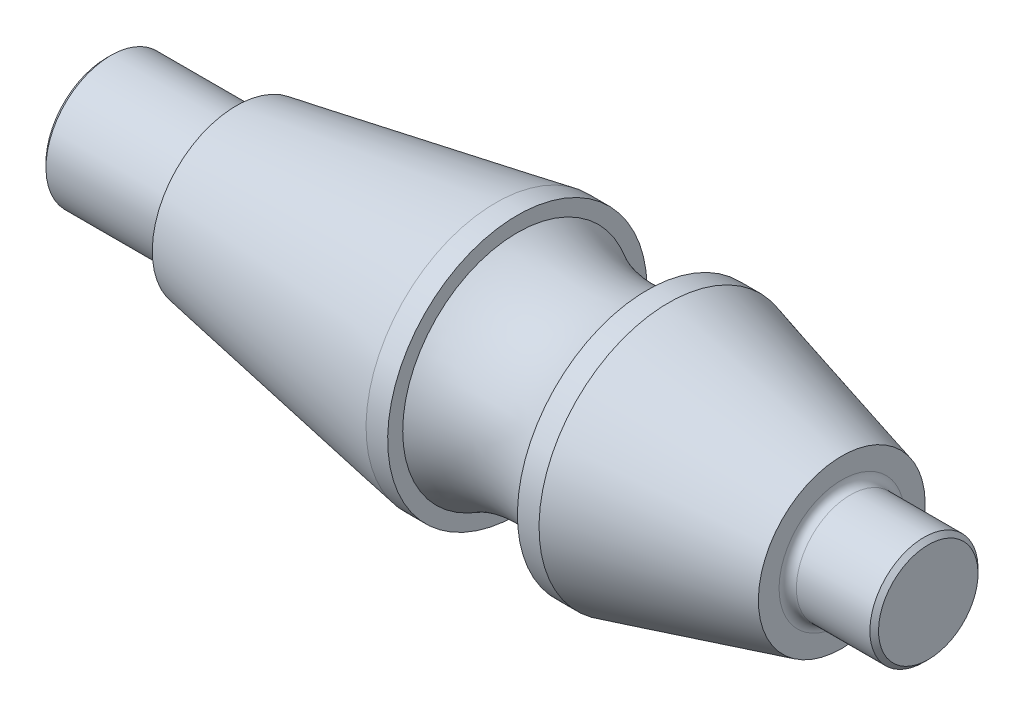
ISO-10303-21;
HEADER;
FILE_DESCRIPTION(('STEP AP214'),'2;1');
FILE_NAME('part.step','',(''),(''),'','','');
FILE_SCHEMA(('AUTOMOTIVE_DESIGN { 1 0 10303 214 1 1 1 1 }'));
ENDSEC;
DATA;
#1=APPLICATION_CONTEXT('core data for automotive mechanical design processes');
#2=APPLICATION_PROTOCOL_DEFINITION('international standard','automotive_design',2000,#1);
#3=PRODUCT_CONTEXT('',#1,'mechanical');
#4=PRODUCT('Part','Part','',(#3));
#5=PRODUCT_RELATED_PRODUCT_CATEGORY('part','',(#4));
#6=PRODUCT_DEFINITION_FORMATION('','',#4);
#7=PRODUCT_DEFINITION_CONTEXT('part definition',#1,'design');
#8=PRODUCT_DEFINITION('design','',#6,#7);
#9=PRODUCT_DEFINITION_SHAPE('','',#8);
#10=(LENGTH_UNIT() NAMED_UNIT(*) SI_UNIT(.MILLI.,.METRE.));
#11=(NAMED_UNIT(*) PLANE_ANGLE_UNIT() SI_UNIT($,.RADIAN.));
#12=(NAMED_UNIT(*) SI_UNIT($,.STERADIAN.) SOLID_ANGLE_UNIT());
#13=UNCERTAINTY_MEASURE_WITH_UNIT(LENGTH_MEASURE(1.E-05),#10,'distance_accuracy_value','');
#14=(GEOMETRIC_REPRESENTATION_CONTEXT(3) GLOBAL_UNCERTAINTY_ASSIGNED_CONTEXT((#13)) GLOBAL_UNIT_ASSIGNED_CONTEXT((#10,
#11,#12)) REPRESENTATION_CONTEXT('',''));
#15=CARTESIAN_POINT('',(0.,0.,0.));
#16=DIRECTION('',(0.,0.,1.));
#17=DIRECTION('',(1.,0.,0.));
#18=AXIS2_PLACEMENT_3D('',#15,#16,#17);
#19=CARTESIAN_POINT('',(95.,12.5,0.));
#20=DIRECTION('',(-1.,0.,0.));
#21=DIRECTION('',(0.,-1.,0.));
#22=AXIS2_PLACEMENT_3D('',#19,#20,#21);
#23=PLANE('',#22);
#24=CARTESIAN_POINT('',(95.,0.,0.));
#25=DIRECTION('',(-1.,0.,0.));
#26=DIRECTION('',(0.,-1.,0.));
#27=AXIS2_PLACEMENT_3D('',#24,#25,#26);
#28=CIRCLE('',#27,11.5);
#29=CARTESIAN_POINT('',(95.,-11.4999999999999,0.));
#30=VERTEX_POINT('',#29);
#31=EDGE_CURVE('E124',#30,#30,#28,.F.);
#32=ORIENTED_EDGE('',*,*,#31,.T.);
#33=EDGE_LOOP('',(#32));
#34=FACE_BOUND('',#33,.T.);
#35=ADVANCED_FACE('F51',(#34),#23,.F.);
#36=CARTESIAN_POINT('',(-95.,0.,0.));
#37=DIRECTION('',(-1.,0.,0.));
#38=DIRECTION('',(0.,-1.,0.));
#39=AXIS2_PLACEMENT_3D('',#36,#37,#38);
#40=CYLINDRICAL_SURFACE('',#39,12.5);
#41=CARTESIAN_POINT('',(77.,0.,0.));
#42=DIRECTION('',(-1.,0.,0.));
#43=DIRECTION('',(0.,-1.,0.));
#44=AXIS2_PLACEMENT_3D('',#41,#42,#43);
#45=CIRCLE('',#44,12.5);
#46=CARTESIAN_POINT('',(77.,-12.4999999999999,0.));
#47=VERTEX_POINT('',#46);
#48=EDGE_CURVE('E132',#47,#47,#45,.F.);
#49=ORIENTED_EDGE('',*,*,#48,.T.);
#50=EDGE_LOOP('',(#49));
#51=FACE_BOUND('',#50,.T.);
#52=CARTESIAN_POINT('',(94.,0.,0.));
#53=DIRECTION('',(-1.,0.,0.));
#54=DIRECTION('',(0.,-1.,0.));
#55=AXIS2_PLACEMENT_3D('',#52,#53,#54);
#56=CIRCLE('',#55,12.5);
#57=CARTESIAN_POINT('',(94.,-12.4999999999999,0.));
#58=VERTEX_POINT('',#57);
#59=EDGE_CURVE('E120',#58,#58,#56,.T.);
#60=ORIENTED_EDGE('',*,*,#59,.T.);
#61=EDGE_LOOP('',(#60));
#62=FACE_BOUND('',#61,.T.);
#63=ADVANCED_FACE('F153',(#51,#62),#40,.T.);
#64=CARTESIAN_POINT('',(75.,19.2820323027551,0.));
#65=DIRECTION('',(-1.,0.,0.));
#66=DIRECTION('',(0.,-1.,0.));
#67=AXIS2_PLACEMENT_3D('',#64,#65,#66);
#68=PLANE('',#67);
#69=CARTESIAN_POINT('',(75.,0.,0.));
#70=DIRECTION('',(-1.,0.,0.));
#71=DIRECTION('',(0.,-1.,0.));
#72=AXIS2_PLACEMENT_3D('',#69,#70,#71);
#73=CIRCLE('',#72,14.5);
#74=CARTESIAN_POINT('',(75.,-14.4999999999999,0.));
#75=VERTEX_POINT('',#74);
#76=EDGE_CURVE('E128',#75,#75,#73,.T.);
#77=ORIENTED_EDGE('',*,*,#76,.T.);
#78=EDGE_LOOP('',(#77));
#79=FACE_BOUND('',#78,.T.);
#80=CARTESIAN_POINT('',(75.,0.,0.));
#81=DIRECTION('',(-1.,0.,0.));
#82=DIRECTION('',(0.,-1.,0.));
#83=AXIS2_PLACEMENT_3D('',#80,#81,#82);
#84=CIRCLE('',#83,19.282032302755);
#85=CARTESIAN_POINT('',(75.,-19.282032302755,0.));
#86=VERTEX_POINT('',#85);
#87=EDGE_CURVE('E108',#86,#86,#84,.T.);
#88=ORIENTED_EDGE('',*,*,#87,.F.);
#89=EDGE_LOOP('',(#88));
#90=FACE_BOUND('',#89,.T.);
#91=ADVANCED_FACE('F161',(#79,#90),#68,.F.);
#92=CARTESIAN_POINT('',(75.,0.,0.));
#93=DIRECTION('',(-1.,0.,0.));
#94=DIRECTION('',(0.,-1.,0.));
#95=AXIS2_PLACEMENT_3D('',#92,#93,#94);
#96=CONICAL_SURFACE('',#95,19.282032302755,0.26179938779915);
#97=CARTESIAN_POINT('',(35.,0.,0.));
#98=DIRECTION('',(-1.,0.,0.));
#99=DIRECTION('',(0.,-1.,0.));
#100=AXIS2_PLACEMENT_3D('',#97,#98,#99);
#101=CIRCLE('',#100,30.);
#102=CARTESIAN_POINT('',(35.,-30.,0.));
#103=VERTEX_POINT('',#102);
#104=EDGE_CURVE('E104',#103,#103,#101,.T.);
#105=ORIENTED_EDGE('',*,*,#104,.F.);
#106=EDGE_LOOP('',(#105));
#107=FACE_BOUND('',#106,.T.);
#108=ORIENTED_EDGE('',*,*,#87,.T.);
#109=EDGE_LOOP('',(#108));
#110=FACE_BOUND('',#109,.T.);
#111=ADVANCED_FACE('F199',(#107,#110),#96,.T.);
#112=CARTESIAN_POINT('',(-95.,0.,0.));
#113=DIRECTION('',(-1.,0.,0.));
#114=DIRECTION('',(0.,-1.,0.));
#115=AXIS2_PLACEMENT_3D('',#112,#113,#114);
#116=CYLINDRICAL_SURFACE('',#115,30.);
#117=CARTESIAN_POINT('',(30.,0.,0.));
#118=DIRECTION('',(-1.,0.,0.));
#119=DIRECTION('',(0.,-1.,0.));
#120=AXIS2_PLACEMENT_3D('',#117,#118,#119);
#121=CIRCLE('',#120,30.);
#122=CARTESIAN_POINT('',(30.,-30.,0.));
#123=VERTEX_POINT('',#122);
#124=EDGE_CURVE('E100',#123,#123,#121,.T.);
#125=ORIENTED_EDGE('',*,*,#124,.F.);
#126=EDGE_LOOP('',(#125));
#127=FACE_BOUND('',#126,.T.);
#128=ORIENTED_EDGE('',*,*,#104,.T.);
#129=EDGE_LOOP('',(#128));
#130=FACE_BOUND('',#129,.T.);
#131=ADVANCED_FACE('F319',(#127,#130),#116,.T.);
#132=CARTESIAN_POINT('',(30.,30.,0.));
#133=DIRECTION('',(1.,0.,0.));
#134=DIRECTION('',(0.,1.,0.));
#135=AXIS2_PLACEMENT_3D('',#132,#133,#134);
#136=PLANE('',#135);
#137=CARTESIAN_POINT('',(30.,0.,0.));
#138=DIRECTION('',(-1.,0.,0.));
#139=DIRECTION('',(0.,-1.,0.));
#140=AXIS2_PLACEMENT_3D('',#137,#138,#139);
#141=CIRCLE('',#140,26.5192378864668);
#142=CARTESIAN_POINT('',(30.,-26.5192378864668,0.));
#143=VERTEX_POINT('',#142);
#144=EDGE_CURVE('E96',#143,#143,#141,.T.);
#145=ORIENTED_EDGE('',*,*,#144,.F.);
#146=EDGE_LOOP('',(#145));
#147=FACE_BOUND('',#146,.T.);
#148=ORIENTED_EDGE('',*,*,#124,.T.);
#149=EDGE_LOOP('',(#148));
#150=FACE_BOUND('',#149,.T.);
#151=ADVANCED_FACE('F310',(#147,#150),#136,.F.);
#152=CARTESIAN_POINT('',(15.,0.,0.));
#153=DIRECTION('',(-1.,0.,0.));
#154=DIRECTION('',(0.,-1.,0.));
#155=AXIS2_PLACEMENT_3D('',#152,#153,#154);
#156=TOROIDAL_SURFACE('',#155,52.5,30.);
#157=CARTESIAN_POINT('',(0.,0.,0.));
#158=DIRECTION('',(-1.,0.,0.));
#159=DIRECTION('',(0.,-1.,0.));
#160=AXIS2_PLACEMENT_3D('',#157,#158,#159);
#161=CIRCLE('',#160,26.5192378864668);
#162=CARTESIAN_POINT('',(0.,-26.5192378864668,0.));
#163=VERTEX_POINT('',#162);
#164=EDGE_CURVE('E92',#163,#163,#161,.T.);
#165=ORIENTED_EDGE('',*,*,#164,.F.);
#166=EDGE_LOOP('',(#165));
#167=FACE_BOUND('',#166,.T.);
#168=ORIENTED_EDGE('',*,*,#144,.T.);
#169=EDGE_LOOP('',(#168));
#170=FACE_BOUND('',#169,.T.);
#171=ADVANCED_FACE('F301',(#167,#170),#156,.F.);
#172=CARTESIAN_POINT('',(0.,30.,0.));
#173=DIRECTION('',(-1.,0.,0.));
#174=DIRECTION('',(0.,-1.,0.));
#175=AXIS2_PLACEMENT_3D('',#172,#173,#174);
#176=PLANE('',#175);
#177=CARTESIAN_POINT('',(0.,0.,0.));
#178=DIRECTION('',(-1.,0.,0.));
#179=DIRECTION('',(0.,-1.,0.));
#180=AXIS2_PLACEMENT_3D('',#177,#178,#179);
#181=CIRCLE('',#180,30.);
#182=CARTESIAN_POINT('',(0.,-30.,0.));
#183=VERTEX_POINT('',#182);
#184=EDGE_CURVE('E88',#183,#183,#181,.T.);
#185=ORIENTED_EDGE('',*,*,#184,.F.);
#186=EDGE_LOOP('',(#185));
#187=FACE_BOUND('',#186,.T.);
#188=ORIENTED_EDGE('',*,*,#164,.T.);
#189=EDGE_LOOP('',(#188));
#190=FACE_BOUND('',#189,.T.);
#191=ADVANCED_FACE('F292',(#187,#190),#176,.F.);
#192=CARTESIAN_POINT('',(-95.,0.,0.));
#193=DIRECTION('',(-1.,0.,0.));
#194=DIRECTION('',(0.,-1.,0.));
#195=AXIS2_PLACEMENT_3D('',#192,#193,#194);
#196=CYLINDRICAL_SURFACE('',#195,30.);
#197=CARTESIAN_POINT('',(-4.99999999999999,0.,0.));
#198=DIRECTION('',(-1.,0.,0.));
#199=DIRECTION('',(0.,-1.,0.));
#200=AXIS2_PLACEMENT_3D('',#197,#198,#199);
#201=CIRCLE('',#200,30.);
#202=CARTESIAN_POINT('',(-4.99999999999999,-30.,0.));
#203=VERTEX_POINT('',#202);
#204=EDGE_CURVE('E78',#203,#203,#201,.T.);
#205=ORIENTED_EDGE('',*,*,#204,.F.);
#206=EDGE_LOOP('',(#205));
#207=FACE_BOUND('',#206,.T.);
#208=ORIENTED_EDGE('',*,*,#184,.T.);
#209=EDGE_LOOP('',(#208));
#210=FACE_BOUND('',#209,.T.);
#211=ADVANCED_FACE('F283',(#207,#210),#196,.T.);
#212=CARTESIAN_POINT('',(-4.99999999999999,0.,0.));
#213=DIRECTION('',(1.,0.,0.));
#214=DIRECTION('',(0.,1.,0.));
#215=AXIS2_PLACEMENT_3D('',#212,#213,#214);
#216=CONICAL_SURFACE('',#215,30.,0.174532925199434);
#217=CARTESIAN_POINT('',(-65.,0.,0.));
#218=DIRECTION('',(-1.,0.,0.));
#219=DIRECTION('',(0.,-1.,0.));
#220=AXIS2_PLACEMENT_3D('',#217,#218,#219);
#221=CIRCLE('',#220,19.420381157492);
#222=CARTESIAN_POINT('',(-65.,-19.420381157492,0.));
#223=VERTEX_POINT('',#222);
#224=EDGE_CURVE('E72',#223,#223,#221,.T.);
#225=ORIENTED_EDGE('',*,*,#224,.F.);
#226=EDGE_LOOP('',(#225));
#227=FACE_BOUND('',#226,.T.);
#228=ORIENTED_EDGE('',*,*,#204,.T.);
#229=EDGE_LOOP('',(#228));
#230=FACE_BOUND('',#229,.T.);
#231=ADVANCED_FACE('F209',(#227,#230),#216,.T.);
#232=CARTESIAN_POINT('',(-65.,15.,0.));
#233=DIRECTION('',(1.,0.,0.));
#234=DIRECTION('',(0.,1.,0.));
#235=AXIS2_PLACEMENT_3D('',#232,#233,#234);
#236=PLANE('',#235);
#237=CARTESIAN_POINT('',(-65.,0.,0.));
#238=DIRECTION('',(1.,0.,0.));
#239=DIRECTION('',(0.,1.,0.));
#240=AXIS2_PLACEMENT_3D('',#237,#238,#239);
#241=CIRCLE('',#240,17.);
#242=CARTESIAN_POINT('',(-65.,17.,0.));
#243=VERTEX_POINT('',#242);
#244=EDGE_CURVE('E11',#243,#243,#241,.T.);
#245=ORIENTED_EDGE('',*,*,#244,.T.);
#246=EDGE_LOOP('',(#245));
#247=FACE_BOUND('',#246,.T.);
#248=ORIENTED_EDGE('',*,*,#224,.T.);
#249=EDGE_LOOP('',(#248));
#250=FACE_BOUND('',#249,.T.);
#251=ADVANCED_FACE('F205',(#247,#250),#236,.F.);
#252=CARTESIAN_POINT('',(-95.,0.,0.));
#253=DIRECTION('',(-1.,0.,0.));
#254=DIRECTION('',(0.,-1.,0.));
#255=AXIS2_PLACEMENT_3D('',#252,#253,#254);
#256=CYLINDRICAL_SURFACE('',#255,15.);
#257=CARTESIAN_POINT('',(-67.,0.,0.));
#258=DIRECTION('',(1.,0.,0.));
#259=DIRECTION('',(0.,1.,0.));
#260=AXIS2_PLACEMENT_3D('',#257,#258,#259);
#261=CIRCLE('',#260,15.);
#262=CARTESIAN_POINT('',(-67.,15.,0.));
#263=VERTEX_POINT('',#262);
#264=EDGE_CURVE('E59',#263,#263,#261,.F.);
#265=ORIENTED_EDGE('',*,*,#264,.T.);
#266=EDGE_LOOP('',(#265));
#267=FACE_BOUND('',#266,.T.);
#268=CARTESIAN_POINT('',(-94.,0.,0.));
#269=DIRECTION('',(1.,0.,0.));
#270=DIRECTION('',(0.,1.,0.));
#271=AXIS2_PLACEMENT_3D('',#268,#269,#270);
#272=CIRCLE('',#271,15.);
#273=CARTESIAN_POINT('',(-94.,15.,0.));
#274=VERTEX_POINT('',#273);
#275=EDGE_CURVE('E116',#274,#274,#272,.T.);
#276=ORIENTED_EDGE('',*,*,#275,.T.);
#277=EDGE_LOOP('',(#276));
#278=FACE_BOUND('',#277,.T.);
#279=ADVANCED_FACE('F139',(#267,#278),#256,.T.);
#280=CARTESIAN_POINT('',(-95.,0.,0.));
#281=DIRECTION('',(1.,0.,0.));
#282=DIRECTION('',(0.,1.,0.));
#283=AXIS2_PLACEMENT_3D('',#280,#281,#282);
#284=PLANE('',#283);
#285=CARTESIAN_POINT('',(-95.,0.,0.));
#286=DIRECTION('',(-1.,0.,0.));
#287=DIRECTION('',(0.,0.,1.));
#288=AXIS2_PLACEMENT_3D('',#285,#286,#287);
#289=CIRCLE('',#288,5.025);
#290=CARTESIAN_POINT('',(-95.,0.,5.025));
#291=VERTEX_POINT('',#290);
#292=EDGE_CURVE('E81',#291,#291,#289,.T.);
#293=ORIENTED_EDGE('',*,*,#292,.F.);
#294=EDGE_LOOP('',(#293));
#295=FACE_BOUND('',#294,.T.);
#296=CARTESIAN_POINT('',(-95.,0.,0.));
#297=DIRECTION('',(1.,0.,0.));
#298=DIRECTION('',(0.,1.,0.));
#299=AXIS2_PLACEMENT_3D('',#296,#297,#298);
#300=CIRCLE('',#299,14.);
#301=CARTESIAN_POINT('',(-95.,14.,0.));
#302=VERTEX_POINT('',#301);
#303=EDGE_CURVE('E112',#302,#302,#300,.F.);
#304=ORIENTED_EDGE('',*,*,#303,.T.);
#305=EDGE_LOOP('',(#304));
#306=FACE_BOUND('',#305,.T.);
#307=ADVANCED_FACE('F172',(#295,#306),#284,.F.);
#308=CARTESIAN_POINT('',(-95.,0.,0.));
#309=DIRECTION('',(1.,0.,0.));
#310=DIRECTION('',(0.,1.,0.));
#311=AXIS2_PLACEMENT_3D('',#308,#309,#310);
#312=CONICAL_SURFACE('',#311,14.,0.785398163397447);
#313=ORIENTED_EDGE('',*,*,#275,.F.);
#314=EDGE_LOOP('',(#313));
#315=FACE_BOUND('',#314,.T.);
#316=ORIENTED_EDGE('',*,*,#303,.F.);
#317=EDGE_LOOP('',(#316));
#318=FACE_BOUND('',#317,.T.);
#319=ADVANCED_FACE('F167',(#315,#318),#312,.T.);
#320=CARTESIAN_POINT('',(94.,0.,0.));
#321=DIRECTION('',(-1.,0.,0.));
#322=DIRECTION('',(0.,-1.,0.));
#323=AXIS2_PLACEMENT_3D('',#320,#321,#322);
#324=CONICAL_SURFACE('',#323,12.5,0.785398163397441);
#325=ORIENTED_EDGE('',*,*,#31,.F.);
#326=EDGE_LOOP('',(#325));
#327=FACE_BOUND('',#326,.T.);
#328=ORIENTED_EDGE('',*,*,#59,.F.);
#329=EDGE_LOOP('',(#328));
#330=FACE_BOUND('',#329,.T.);
#331=ADVANCED_FACE('F149',(#327,#330),#324,.T.);
#332=CARTESIAN_POINT('',(77.,0.,0.));
#333=DIRECTION('',(-1.,0.,0.));
#334=DIRECTION('',(0.,-1.,0.));
#335=AXIS2_PLACEMENT_3D('',#332,#333,#334);
#336=TOROIDAL_SURFACE('',#335,14.5,2.);
#337=ORIENTED_EDGE('',*,*,#48,.F.);
#338=EDGE_LOOP('',(#337));
#339=FACE_BOUND('',#338,.T.);
#340=ORIENTED_EDGE('',*,*,#76,.F.);
#341=EDGE_LOOP('',(#340));
#342=FACE_BOUND('',#341,.T.);
#343=ADVANCED_FACE('F143',(#339,#342),#336,.F.);
#344=CARTESIAN_POINT('',(-67.,0.,0.));
#345=DIRECTION('',(1.,0.,0.));
#346=DIRECTION('',(0.,1.,0.));
#347=AXIS2_PLACEMENT_3D('',#344,#345,#346);
#348=TOROIDAL_SURFACE('',#347,17.,2.);
#349=ORIENTED_EDGE('',*,*,#244,.F.);
#350=EDGE_LOOP('',(#349));
#351=FACE_BOUND('',#350,.T.);
#352=ORIENTED_EDGE('',*,*,#264,.F.);
#353=EDGE_LOOP('',(#352));
#354=FACE_BOUND('',#353,.T.);
#355=ADVANCED_FACE('F53',(#351,#354),#348,.F.);
#356=CARTESIAN_POINT('',(-80.,0.,0.));
#357=DIRECTION('',(-1.,0.,0.));
#358=DIRECTION('',(0.,0.,1.));
#359=AXIS2_PLACEMENT_3D('',#356,#357,#358);
#360=CONICAL_SURFACE('',#359,4.25,1.02974425867665);
#361=CARTESIAN_POINT('',(-77.4463423691329,0.,0.));
#362=VERTEX_POINT('',#361);
#363=VERTEX_LOOP('',#362);
#364=FACE_BOUND('',#363,.T.);
#365=CARTESIAN_POINT('',(-80.,0.,0.));
#366=DIRECTION('',(-1.,0.,0.));
#367=DIRECTION('',(0.,0.,1.));
#368=AXIS2_PLACEMENT_3D('',#365,#366,#367);
#369=CIRCLE('',#368,4.25);
#370=CARTESIAN_POINT('',(-80.,0.,4.25));
#371=VERTEX_POINT('',#370);
#372=EDGE_CURVE('E69',#371,#371,#369,.T.);
#373=ORIENTED_EDGE('',*,*,#372,.T.);
#374=EDGE_LOOP('',(#373));
#375=FACE_BOUND('',#374,.T.);
#376=ADVANCED_FACE('F62',(#364,#375),#360,.F.);
#377=CARTESIAN_POINT('',(-95.,0.,0.));
#378=DIRECTION('',(-1.,0.,0.));
#379=DIRECTION('',(0.,0.,1.));
#380=AXIS2_PLACEMENT_3D('',#377,#378,#379);
#381=CYLINDRICAL_SURFACE('',#380,4.25);
#382=ORIENTED_EDGE('',*,*,#372,.F.);
#383=EDGE_LOOP('',(#382));
#384=FACE_BOUND('',#383,.T.);
#385=CARTESIAN_POINT('',(-94.225,0.,0.));
#386=DIRECTION('',(-1.,0.,0.));
#387=DIRECTION('',(0.,0.,1.));
#388=AXIS2_PLACEMENT_3D('',#385,#386,#387);
#389=CIRCLE('',#388,4.25);
#390=CARTESIAN_POINT('',(-94.225,0.,4.25));
#391=VERTEX_POINT('',#390);
#392=EDGE_CURVE('E73',#391,#391,#389,.T.);
#393=ORIENTED_EDGE('',*,*,#392,.T.);
#394=EDGE_LOOP('',(#393));
#395=FACE_BOUND('',#394,.T.);
#396=ADVANCED_FACE('F65',(#384,#395),#381,.F.);
#397=CARTESIAN_POINT('',(-95.,0.,0.));
#398=DIRECTION('',(-1.,0.,0.));
#399=DIRECTION('',(0.,0.,1.));
#400=AXIS2_PLACEMENT_3D('',#397,#398,#399);
#401=CONICAL_SURFACE('',#400,5.025,0.785398163397451);
#402=ORIENTED_EDGE('',*,*,#392,.F.);
#403=EDGE_LOOP('',(#402));
#404=FACE_BOUND('',#403,.T.);
#405=ORIENTED_EDGE('',*,*,#292,.T.);
#406=EDGE_LOOP('',(#405));
#407=FACE_BOUND('',#406,.T.);
#408=ADVANCED_FACE('F245',(#404,#407),#401,.F.);
#409=CLOSED_SHELL('',(#35,#63,#91,#111,#131,#151,#171,#191,#211,#231,#251,#279,#307,#319,#331,
#343,#355,#376,#396,#408));
#410=MANIFOLD_SOLID_BREP('B2',#409);
#411=ADVANCED_BREP_SHAPE_REPRESENTATION('',(#18,#410),#14);
#412=SHAPE_DEFINITION_REPRESENTATION(#9,#411);
ENDSEC;
END-ISO-10303-21;
